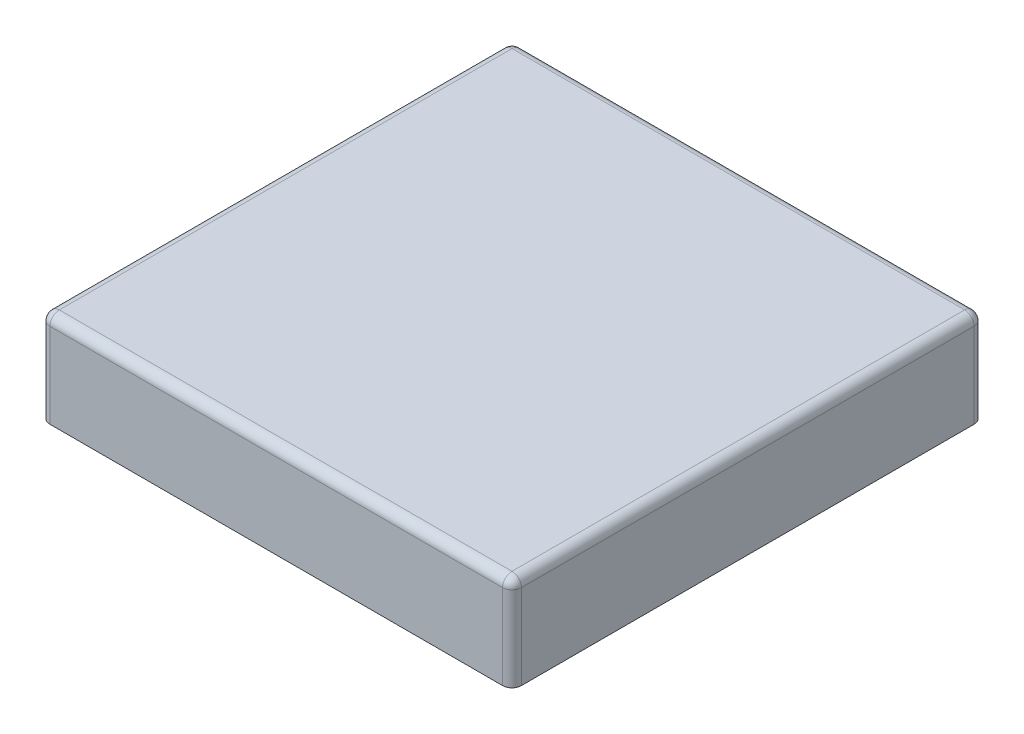
ISO-10303-21;
HEADER;
FILE_DESCRIPTION(('STEP AP214'),'2;1');
FILE_NAME('part.step','',(''),(''),'','','');
FILE_SCHEMA(('AUTOMOTIVE_DESIGN { 1 0 10303 214 1 1 1 1 }'));
ENDSEC;
DATA;
#1=APPLICATION_CONTEXT('core data for automotive mechanical design processes');
#2=APPLICATION_PROTOCOL_DEFINITION('international standard','automotive_design',2000,#1);
#3=PRODUCT_CONTEXT('',#1,'mechanical');
#4=PRODUCT('Part','Part','',(#3));
#5=PRODUCT_RELATED_PRODUCT_CATEGORY('part','',(#4));
#6=PRODUCT_DEFINITION_FORMATION('','',#4);
#7=PRODUCT_DEFINITION_CONTEXT('part definition',#1,'design');
#8=PRODUCT_DEFINITION('design','',#6,#7);
#9=PRODUCT_DEFINITION_SHAPE('','',#8);
#10=(LENGTH_UNIT() NAMED_UNIT(*) SI_UNIT(.MILLI.,.METRE.));
#11=(NAMED_UNIT(*) PLANE_ANGLE_UNIT() SI_UNIT($,.RADIAN.));
#12=(NAMED_UNIT(*) SI_UNIT($,.STERADIAN.) SOLID_ANGLE_UNIT());
#13=UNCERTAINTY_MEASURE_WITH_UNIT(LENGTH_MEASURE(1.E-05),#10,'distance_accuracy_value','');
#14=(GEOMETRIC_REPRESENTATION_CONTEXT(3) GLOBAL_UNCERTAINTY_ASSIGNED_CONTEXT((#13)) GLOBAL_UNIT_ASSIGNED_CONTEXT((#10,
#11,#12)) REPRESENTATION_CONTEXT('',''));
#15=CARTESIAN_POINT('',(0.,0.,0.));
#16=DIRECTION('',(0.,0.,1.));
#17=DIRECTION('',(1.,0.,0.));
#18=AXIS2_PLACEMENT_3D('',#15,#16,#17);
#19=CARTESIAN_POINT('',(0.,1.,0.));
#20=DIRECTION('',(1.,0.,0.));
#21=DIRECTION('',(0.,0.,-1.));
#22=AXIS2_PLACEMENT_3D('',#19,#20,#21);
#23=PLANE('',#22);
#24=DIRECTION('',(0.,0.,1.));
#25=VECTOR('',#24,1.);
#26=CARTESIAN_POINT('',(0.,0.9,0.));
#27=LINE('',#26,#25);
#28=CARTESIAN_POINT('',(0.,0.9,-0.1));
#29=VERTEX_POINT('',#28);
#30=CARTESIAN_POINT('',(0.,0.9,-4.9));
#31=VERTEX_POINT('',#30);
#32=EDGE_CURVE('E217',#29,#31,#27,.F.);
#33=ORIENTED_EDGE('',*,*,#32,.T.);
#34=DIRECTION('',(0.,-1.,0.));
#35=VECTOR('',#34,1.);
#36=CARTESIAN_POINT('',(0.,1.,-4.9));
#37=LINE('',#36,#35);
#38=CARTESIAN_POINT('',(0.,0.,-4.9));
#39=VERTEX_POINT('',#38);
#40=EDGE_CURVE('E11',#31,#39,#37,.T.);
#41=ORIENTED_EDGE('',*,*,#40,.T.);
#42=DIRECTION('',(0.,0.,1.));
#43=VECTOR('',#42,1.);
#44=CARTESIAN_POINT('',(0.,0.,0.));
#45=LINE('',#44,#43);
#46=CARTESIAN_POINT('',(0.,0.,-0.1));
#47=VERTEX_POINT('',#46);
#48=EDGE_CURVE('E183',#39,#47,#45,.T.);
#49=ORIENTED_EDGE('',*,*,#48,.T.);
#50=DIRECTION('',(0.,-1.,0.));
#51=VECTOR('',#50,1.);
#52=CARTESIAN_POINT('',(0.,1.,-0.1));
#53=LINE('',#52,#51);
#54=EDGE_CURVE('E43',#47,#29,#53,.F.);
#55=ORIENTED_EDGE('',*,*,#54,.T.);
#56=EDGE_LOOP('',(#33,#41,#49,#55));
#57=FACE_BOUND('',#56,.T.);
#58=ADVANCED_FACE('F34',(#57),#23,.F.);
#59=CARTESIAN_POINT('',(0.,1.,0.));
#60=DIRECTION('',(0.,0.,-1.));
#61=DIRECTION('',(-1.,0.,0.));
#62=AXIS2_PLACEMENT_3D('',#59,#60,#61);
#63=PLANE('',#62);
#64=DIRECTION('',(1.,0.,0.));
#65=VECTOR('',#64,1.);
#66=CARTESIAN_POINT('',(0.,0.,0.));
#67=LINE('',#66,#65);
#68=CARTESIAN_POINT('',(0.1,0.,0.));
#69=VERTEX_POINT('',#68);
#70=CARTESIAN_POINT('',(4.9,0.,0.));
#71=VERTEX_POINT('',#70);
#72=EDGE_CURVE('E202',#69,#71,#67,.T.);
#73=ORIENTED_EDGE('',*,*,#72,.T.);
#74=DIRECTION('',(0.,-1.,0.));
#75=VECTOR('',#74,1.);
#76=CARTESIAN_POINT('',(4.9,1.,0.));
#77=LINE('',#76,#75);
#78=CARTESIAN_POINT('',(4.9,0.9,0.));
#79=VERTEX_POINT('',#78);
#80=EDGE_CURVE('E173',#71,#79,#77,.F.);
#81=ORIENTED_EDGE('',*,*,#80,.T.);
#82=DIRECTION('',(1.,0.,0.));
#83=VECTOR('',#82,1.);
#84=CARTESIAN_POINT('',(0.,0.9,0.));
#85=LINE('',#84,#83);
#86=CARTESIAN_POINT('',(0.1,0.9,0.));
#87=VERTEX_POINT('',#86);
#88=EDGE_CURVE('E219',#79,#87,#85,.F.);
#89=ORIENTED_EDGE('',*,*,#88,.T.);
#90=DIRECTION('',(0.,-1.,0.));
#91=VECTOR('',#90,1.);
#92=CARTESIAN_POINT('',(0.1,1.,0.));
#93=LINE('',#92,#91);
#94=EDGE_CURVE('E58',#87,#69,#93,.T.);
#95=ORIENTED_EDGE('',*,*,#94,.T.);
#96=EDGE_LOOP('',(#73,#81,#89,#95));
#97=FACE_BOUND('',#96,.T.);
#98=ADVANCED_FACE('F240',(#97),#63,.F.);
#99=CARTESIAN_POINT('',(5.,1.,0.));
#100=DIRECTION('',(-1.,0.,0.));
#101=DIRECTION('',(0.,0.,1.));
#102=AXIS2_PLACEMENT_3D('',#99,#100,#101);
#103=PLANE('',#102);
#104=DIRECTION('',(0.,0.,-1.));
#105=VECTOR('',#104,1.);
#106=CARTESIAN_POINT('',(5.,0.9,0.));
#107=LINE('',#106,#105);
#108=CARTESIAN_POINT('',(5.,0.9,-4.9));
#109=VERTEX_POINT('',#108);
#110=CARTESIAN_POINT('',(5.,0.9,-0.1));
#111=VERTEX_POINT('',#110);
#112=EDGE_CURVE('E120',#109,#111,#107,.F.);
#113=ORIENTED_EDGE('',*,*,#112,.T.);
#114=DIRECTION('',(0.,-1.,0.));
#115=VECTOR('',#114,1.);
#116=CARTESIAN_POINT('',(5.,1.,-0.1));
#117=LINE('',#116,#115);
#118=CARTESIAN_POINT('',(5.,0.,-0.1));
#119=VERTEX_POINT('',#118);
#120=EDGE_CURVE('E163',#111,#119,#117,.T.);
#121=ORIENTED_EDGE('',*,*,#120,.T.);
#122=DIRECTION('',(0.,0.,-1.));
#123=VECTOR('',#122,1.);
#124=CARTESIAN_POINT('',(5.,0.,0.));
#125=LINE('',#124,#123);
#126=CARTESIAN_POINT('',(5.,0.,-4.9));
#127=VERTEX_POINT('',#126);
#128=EDGE_CURVE('E207',#119,#127,#125,.T.);
#129=ORIENTED_EDGE('',*,*,#128,.T.);
#130=DIRECTION('',(0.,-1.,0.));
#131=VECTOR('',#130,1.);
#132=CARTESIAN_POINT('',(5.,1.,-4.9));
#133=LINE('',#132,#131);
#134=EDGE_CURVE('E161',#127,#109,#133,.F.);
#135=ORIENTED_EDGE('',*,*,#134,.T.);
#136=EDGE_LOOP('',(#113,#121,#129,#135));
#137=FACE_BOUND('',#136,.T.);
#138=ADVANCED_FACE('F230',(#137),#103,.F.);
#139=CARTESIAN_POINT('',(0.,1.,-5.));
#140=DIRECTION('',(0.,0.,1.));
#141=DIRECTION('',(1.,0.,0.));
#142=AXIS2_PLACEMENT_3D('',#139,#140,#141);
#143=PLANE('',#142);
#144=DIRECTION('',(-1.,0.,0.));
#145=VECTOR('',#144,1.);
#146=CARTESIAN_POINT('',(0.,0.9,-5.));
#147=LINE('',#146,#145);
#148=CARTESIAN_POINT('',(0.1,0.9,-5.));
#149=VERTEX_POINT('',#148);
#150=CARTESIAN_POINT('',(4.9,0.9,-5.));
#151=VERTEX_POINT('',#150);
#152=EDGE_CURVE('E222',#149,#151,#147,.F.);
#153=ORIENTED_EDGE('',*,*,#152,.T.);
#154=DIRECTION('',(0.,-1.,0.));
#155=VECTOR('',#154,1.);
#156=CARTESIAN_POINT('',(4.9,1.,-5.));
#157=LINE('',#156,#155);
#158=CARTESIAN_POINT('',(4.9,0.,-5.));
#159=VERTEX_POINT('',#158);
#160=EDGE_CURVE('E177',#151,#159,#157,.T.);
#161=ORIENTED_EDGE('',*,*,#160,.T.);
#162=DIRECTION('',(-1.,0.,0.));
#163=VECTOR('',#162,1.);
#164=CARTESIAN_POINT('',(0.,0.,-5.));
#165=LINE('',#164,#163);
#166=CARTESIAN_POINT('',(0.1,0.,-5.));
#167=VERTEX_POINT('',#166);
#168=EDGE_CURVE('E146',#159,#167,#165,.T.);
#169=ORIENTED_EDGE('',*,*,#168,.T.);
#170=DIRECTION('',(0.,-1.,0.));
#171=VECTOR('',#170,1.);
#172=CARTESIAN_POINT('',(0.1,1.,-5.));
#173=LINE('',#172,#171);
#174=EDGE_CURVE('E175',#167,#149,#173,.F.);
#175=ORIENTED_EDGE('',*,*,#174,.T.);
#176=EDGE_LOOP('',(#153,#161,#169,#175));
#177=FACE_BOUND('',#176,.T.);
#178=ADVANCED_FACE('F247',(#177),#143,.F.);
#179=CARTESIAN_POINT('',(0.,1.,0.));
#180=DIRECTION('',(0.,-1.,0.));
#181=DIRECTION('',(0.,0.,-1.));
#182=AXIS2_PLACEMENT_3D('',#179,#180,#181);
#183=PLANE('',#182);
#184=DIRECTION('',(-1.,0.,0.));
#185=VECTOR('',#184,1.);
#186=CARTESIAN_POINT('',(0.,1.,-4.9));
#187=LINE('',#186,#185);
#188=CARTESIAN_POINT('',(4.9,1.,-4.9));
#189=VERTEX_POINT('',#188);
#190=CARTESIAN_POINT('',(0.1,1.,-4.9));
#191=VERTEX_POINT('',#190);
#192=EDGE_CURVE('E133',#189,#191,#187,.T.);
#193=ORIENTED_EDGE('',*,*,#192,.T.);
#194=DIRECTION('',(0.,0.,1.));
#195=VECTOR('',#194,1.);
#196=CARTESIAN_POINT('',(0.1,1.,0.));
#197=LINE('',#196,#195);
#198=CARTESIAN_POINT('',(0.1,1.,-0.1));
#199=VERTEX_POINT('',#198);
#200=EDGE_CURVE('E215',#191,#199,#197,.T.);
#201=ORIENTED_EDGE('',*,*,#200,.T.);
#202=DIRECTION('',(1.,0.,0.));
#203=VECTOR('',#202,1.);
#204=CARTESIAN_POINT('',(0.,1.,-0.1));
#205=LINE('',#204,#203);
#206=CARTESIAN_POINT('',(4.9,1.,-0.1));
#207=VERTEX_POINT('',#206);
#208=EDGE_CURVE('E136',#199,#207,#205,.T.);
#209=ORIENTED_EDGE('',*,*,#208,.T.);
#210=DIRECTION('',(0.,0.,-1.));
#211=VECTOR('',#210,1.);
#212=CARTESIAN_POINT('',(4.9,1.,0.));
#213=LINE('',#212,#211);
#214=EDGE_CURVE('E118',#207,#189,#213,.T.);
#215=ORIENTED_EDGE('',*,*,#214,.T.);
#216=EDGE_LOOP('',(#193,#201,#209,#215));
#217=FACE_BOUND('',#216,.T.);
#218=ADVANCED_FACE('F131',(#217),#183,.F.);
#219=CARTESIAN_POINT('',(0.,0.,0.));
#220=DIRECTION('',(0.,-1.,0.));
#221=DIRECTION('',(0.,0.,-1.));
#222=AXIS2_PLACEMENT_3D('',#219,#220,#221);
#223=PLANE('',#222);
#224=ORIENTED_EDGE('',*,*,#128,.F.);
#225=CARTESIAN_POINT('',(4.9,0.,-0.1));
#226=DIRECTION('',(0.,-1.,0.));
#227=DIRECTION('',(0.,0.,-1.));
#228=AXIS2_PLACEMENT_3D('',#225,#226,#227);
#229=CIRCLE('',#228,0.1);
#230=EDGE_CURVE('E51',#119,#71,#229,.T.);
#231=ORIENTED_EDGE('',*,*,#230,.T.);
#232=ORIENTED_EDGE('',*,*,#72,.F.);
#233=CARTESIAN_POINT('',(0.1,0.,-0.1));
#234=DIRECTION('',(0.,-1.,0.));
#235=DIRECTION('',(0.,0.,-1.));
#236=AXIS2_PLACEMENT_3D('',#233,#234,#235);
#237=CIRCLE('',#236,0.1);
#238=EDGE_CURVE('E165',#69,#47,#237,.T.);
#239=ORIENTED_EDGE('',*,*,#238,.T.);
#240=ORIENTED_EDGE('',*,*,#48,.F.);
#241=CARTESIAN_POINT('',(0.1,0.,-4.9));
#242=DIRECTION('',(0.,-1.,0.));
#243=DIRECTION('',(0.,0.,-1.));
#244=AXIS2_PLACEMENT_3D('',#241,#242,#243);
#245=CIRCLE('',#244,0.1);
#246=EDGE_CURVE('E167',#39,#167,#245,.T.);
#247=ORIENTED_EDGE('',*,*,#246,.T.);
#248=ORIENTED_EDGE('',*,*,#168,.F.);
#249=CARTESIAN_POINT('',(4.9,0.,-4.9));
#250=DIRECTION('',(0.,-1.,0.));
#251=DIRECTION('',(0.,0.,-1.));
#252=AXIS2_PLACEMENT_3D('',#249,#250,#251);
#253=CIRCLE('',#252,0.1);
#254=EDGE_CURVE('E169',#159,#127,#253,.T.);
#255=ORIENTED_EDGE('',*,*,#254,.T.);
#256=EDGE_LOOP('',(#224,#231,#232,#239,#240,#247,#248,#255));
#257=FACE_BOUND('',#256,.T.);
#258=ADVANCED_FACE('F200',(#257),#223,.T.);
#259=CARTESIAN_POINT('',(4.9,0.9,0.));
#260=DIRECTION('',(0.,0.,-1.));
#261=DIRECTION('',(-1.,0.,0.));
#262=AXIS2_PLACEMENT_3D('',#259,#260,#261);
#263=CYLINDRICAL_SURFACE('',#262,0.1);
#264=ORIENTED_EDGE('',*,*,#214,.F.);
#265=CARTESIAN_POINT('',(4.9,0.9,-0.1));
#266=DIRECTION('',(0.,0.,-1.));
#267=DIRECTION('',(-1.,0.,0.));
#268=AXIS2_PLACEMENT_3D('',#265,#266,#267);
#269=CIRCLE('',#268,0.1);
#270=EDGE_CURVE('E124',#207,#111,#269,.T.);
#271=ORIENTED_EDGE('',*,*,#270,.T.);
#272=ORIENTED_EDGE('',*,*,#112,.F.);
#273=CARTESIAN_POINT('',(4.9,0.9,-4.9));
#274=DIRECTION('',(0.,0.,-1.));
#275=DIRECTION('',(-1.,0.,0.));
#276=AXIS2_PLACEMENT_3D('',#273,#274,#275);
#277=CIRCLE('',#276,0.1);
#278=EDGE_CURVE('E115',#109,#189,#277,.F.);
#279=ORIENTED_EDGE('',*,*,#278,.T.);
#280=EDGE_LOOP('',(#264,#271,#272,#279));
#281=FACE_BOUND('',#280,.T.);
#282=ADVANCED_FACE('F117',(#281),#263,.T.);
#283=CARTESIAN_POINT('',(0.,0.9,-4.9));
#284=DIRECTION('',(-1.,0.,0.));
#285=DIRECTION('',(0.,0.,1.));
#286=AXIS2_PLACEMENT_3D('',#283,#284,#285);
#287=CYLINDRICAL_SURFACE('',#286,0.1);
#288=ORIENTED_EDGE('',*,*,#192,.F.);
#289=CARTESIAN_POINT('',(4.9,0.9,-4.9));
#290=DIRECTION('',(-1.,0.,0.));
#291=DIRECTION('',(0.,0.,1.));
#292=AXIS2_PLACEMENT_3D('',#289,#290,#291);
#293=CIRCLE('',#292,0.1);
#294=EDGE_CURVE('E142',#189,#151,#293,.T.);
#295=ORIENTED_EDGE('',*,*,#294,.T.);
#296=ORIENTED_EDGE('',*,*,#152,.F.);
#297=CARTESIAN_POINT('',(0.1,0.9,-4.9));
#298=DIRECTION('',(-1.,0.,0.));
#299=DIRECTION('',(0.,0.,1.));
#300=AXIS2_PLACEMENT_3D('',#297,#298,#299);
#301=CIRCLE('',#300,0.1);
#302=EDGE_CURVE('E145',#149,#191,#301,.F.);
#303=ORIENTED_EDGE('',*,*,#302,.T.);
#304=EDGE_LOOP('',(#288,#295,#296,#303));
#305=FACE_BOUND('',#304,.T.);
#306=ADVANCED_FACE('F140',(#305),#287,.T.);
#307=CARTESIAN_POINT('',(0.,0.9,-0.1));
#308=DIRECTION('',(1.,0.,0.));
#309=DIRECTION('',(0.,0.,-1.));
#310=AXIS2_PLACEMENT_3D('',#307,#308,#309);
#311=CYLINDRICAL_SURFACE('',#310,0.1);
#312=ORIENTED_EDGE('',*,*,#88,.F.);
#313=CARTESIAN_POINT('',(4.9,0.9,-0.1));
#314=DIRECTION('',(1.,0.,0.));
#315=DIRECTION('',(0.,0.,-1.));
#316=AXIS2_PLACEMENT_3D('',#313,#314,#315);
#317=CIRCLE('',#316,0.1);
#318=EDGE_CURVE('E125',#79,#207,#317,.F.);
#319=ORIENTED_EDGE('',*,*,#318,.T.);
#320=ORIENTED_EDGE('',*,*,#208,.F.);
#321=CARTESIAN_POINT('',(0.1,0.9,-0.1));
#322=DIRECTION('',(1.,0.,0.));
#323=DIRECTION('',(0.,0.,-1.));
#324=AXIS2_PLACEMENT_3D('',#321,#322,#323);
#325=CIRCLE('',#324,0.1);
#326=EDGE_CURVE('E194',#199,#87,#325,.T.);
#327=ORIENTED_EDGE('',*,*,#326,.T.);
#328=EDGE_LOOP('',(#312,#319,#320,#327));
#329=FACE_BOUND('',#328,.T.);
#330=ADVANCED_FACE('F239',(#329),#311,.T.);
#331=CARTESIAN_POINT('',(0.1,0.9,0.));
#332=DIRECTION('',(0.,0.,1.));
#333=DIRECTION('',(1.,0.,0.));
#334=AXIS2_PLACEMENT_3D('',#331,#332,#333);
#335=CYLINDRICAL_SURFACE('',#334,0.1);
#336=ORIENTED_EDGE('',*,*,#200,.F.);
#337=CARTESIAN_POINT('',(0.1,0.9,-4.9));
#338=DIRECTION('',(0.,0.,1.));
#339=DIRECTION('',(1.,0.,0.));
#340=AXIS2_PLACEMENT_3D('',#337,#338,#339);
#341=CIRCLE('',#340,0.1);
#342=EDGE_CURVE('E154',#191,#31,#341,.T.);
#343=ORIENTED_EDGE('',*,*,#342,.T.);
#344=ORIENTED_EDGE('',*,*,#32,.F.);
#345=CARTESIAN_POINT('',(0.1,0.9,-0.1));
#346=DIRECTION('',(0.,0.,1.));
#347=DIRECTION('',(1.,0.,0.));
#348=AXIS2_PLACEMENT_3D('',#345,#346,#347);
#349=CIRCLE('',#348,0.1);
#350=EDGE_CURVE('E151',#29,#199,#349,.F.);
#351=ORIENTED_EDGE('',*,*,#350,.T.);
#352=EDGE_LOOP('',(#336,#343,#344,#351));
#353=FACE_BOUND('',#352,.T.);
#354=ADVANCED_FACE('F252',(#353),#335,.T.);
#355=CARTESIAN_POINT('',(4.9,1.,-0.1));
#356=DIRECTION('',(0.,-1.,0.));
#357=DIRECTION('',(0.,0.,-1.));
#358=AXIS2_PLACEMENT_3D('',#355,#356,#357);
#359=CYLINDRICAL_SURFACE('',#358,0.1);
#360=ORIENTED_EDGE('',*,*,#230,.F.);
#361=ORIENTED_EDGE('',*,*,#120,.F.);
#362=CARTESIAN_POINT('',(4.9,0.9,-0.1));
#363=DIRECTION('',(0.,1.,0.));
#364=DIRECTION('',(0.,0.,1.));
#365=AXIS2_PLACEMENT_3D('',#362,#363,#364);
#366=CIRCLE('',#365,0.1);
#367=EDGE_CURVE('E180',#79,#111,#366,.T.);
#368=ORIENTED_EDGE('',*,*,#367,.F.);
#369=ORIENTED_EDGE('',*,*,#80,.F.);
#370=EDGE_LOOP('',(#360,#361,#368,#369));
#371=FACE_BOUND('',#370,.T.);
#372=ADVANCED_FACE('F234',(#371),#359,.T.);
#373=CARTESIAN_POINT('',(4.9,0.9,-0.1));
#374=DIRECTION('',(0.,0.,1.));
#375=DIRECTION('',(1.,0.,0.));
#376=AXIS2_PLACEMENT_3D('',#373,#374,#375);
#377=SPHERICAL_SURFACE('',#376,0.1);
#378=ORIENTED_EDGE('',*,*,#367,.T.);
#379=ORIENTED_EDGE('',*,*,#270,.F.);
#380=ORIENTED_EDGE('',*,*,#318,.F.);
#381=EDGE_LOOP('',(#378,#379,#380));
#382=FACE_BOUND('',#381,.T.);
#383=ADVANCED_FACE('F236',(#382),#377,.T.);
#384=CARTESIAN_POINT('',(4.9,1.,-4.9));
#385=DIRECTION('',(0.,-1.,0.));
#386=DIRECTION('',(0.,0.,-1.));
#387=AXIS2_PLACEMENT_3D('',#384,#385,#386);
#388=CYLINDRICAL_SURFACE('',#387,0.1);
#389=ORIENTED_EDGE('',*,*,#254,.F.);
#390=ORIENTED_EDGE('',*,*,#160,.F.);
#391=CARTESIAN_POINT('',(4.9,0.9,-4.9));
#392=DIRECTION('',(0.,1.,0.));
#393=DIRECTION('',(0.,0.,1.));
#394=AXIS2_PLACEMENT_3D('',#391,#392,#393);
#395=CIRCLE('',#394,0.1);
#396=EDGE_CURVE('E149',#109,#151,#395,.T.);
#397=ORIENTED_EDGE('',*,*,#396,.F.);
#398=ORIENTED_EDGE('',*,*,#134,.F.);
#399=EDGE_LOOP('',(#389,#390,#397,#398));
#400=FACE_BOUND('',#399,.T.);
#401=ADVANCED_FACE('F264',(#400),#388,.T.);
#402=CARTESIAN_POINT('',(4.9,0.9,-4.9));
#403=DIRECTION('',(0.,0.,1.));
#404=DIRECTION('',(1.,0.,0.));
#405=AXIS2_PLACEMENT_3D('',#402,#403,#404);
#406=SPHERICAL_SURFACE('',#405,0.1);
#407=ORIENTED_EDGE('',*,*,#294,.F.);
#408=ORIENTED_EDGE('',*,*,#278,.F.);
#409=ORIENTED_EDGE('',*,*,#396,.T.);
#410=EDGE_LOOP('',(#407,#408,#409));
#411=FACE_BOUND('',#410,.T.);
#412=ADVANCED_FACE('F148',(#411),#406,.T.);
#413=CARTESIAN_POINT('',(0.1,1.,-4.9));
#414=DIRECTION('',(0.,-1.,0.));
#415=DIRECTION('',(0.,0.,-1.));
#416=AXIS2_PLACEMENT_3D('',#413,#414,#415);
#417=CYLINDRICAL_SURFACE('',#416,0.1);
#418=ORIENTED_EDGE('',*,*,#246,.F.);
#419=ORIENTED_EDGE('',*,*,#40,.F.);
#420=CARTESIAN_POINT('',(0.1,0.9,-4.9));
#421=DIRECTION('',(0.,1.,0.));
#422=DIRECTION('',(0.,0.,1.));
#423=AXIS2_PLACEMENT_3D('',#420,#421,#422);
#424=CIRCLE('',#423,0.1);
#425=EDGE_CURVE('E184',#149,#31,#424,.T.);
#426=ORIENTED_EDGE('',*,*,#425,.F.);
#427=ORIENTED_EDGE('',*,*,#174,.F.);
#428=EDGE_LOOP('',(#418,#419,#426,#427));
#429=FACE_BOUND('',#428,.T.);
#430=ADVANCED_FACE('F269',(#429),#417,.T.);
#431=CARTESIAN_POINT('',(0.1,0.9,-4.9));
#432=DIRECTION('',(0.,0.,1.));
#433=DIRECTION('',(1.,0.,0.));
#434=AXIS2_PLACEMENT_3D('',#431,#432,#433);
#435=SPHERICAL_SURFACE('',#434,0.1);
#436=ORIENTED_EDGE('',*,*,#342,.F.);
#437=ORIENTED_EDGE('',*,*,#302,.F.);
#438=ORIENTED_EDGE('',*,*,#425,.T.);
#439=EDGE_LOOP('',(#436,#437,#438));
#440=FACE_BOUND('',#439,.T.);
#441=ADVANCED_FACE('F273',(#440),#435,.T.);
#442=CARTESIAN_POINT('',(0.1,1.,-0.1));
#443=DIRECTION('',(0.,-1.,0.));
#444=DIRECTION('',(0.,0.,-1.));
#445=AXIS2_PLACEMENT_3D('',#442,#443,#444);
#446=CYLINDRICAL_SURFACE('',#445,0.1);
#447=ORIENTED_EDGE('',*,*,#238,.F.);
#448=ORIENTED_EDGE('',*,*,#94,.F.);
#449=CARTESIAN_POINT('',(0.1,0.9,-0.1));
#450=DIRECTION('',(0.,1.,0.));
#451=DIRECTION('',(0.,0.,1.));
#452=AXIS2_PLACEMENT_3D('',#449,#450,#451);
#453=CIRCLE('',#452,0.1);
#454=EDGE_CURVE('E38',#29,#87,#453,.T.);
#455=ORIENTED_EDGE('',*,*,#454,.F.);
#456=ORIENTED_EDGE('',*,*,#54,.F.);
#457=EDGE_LOOP('',(#447,#448,#455,#456));
#458=FACE_BOUND('',#457,.T.);
#459=ADVANCED_FACE('F36',(#458),#446,.T.);
#460=CARTESIAN_POINT('',(0.1,0.9,-0.1));
#461=DIRECTION('',(0.,0.,1.));
#462=DIRECTION('',(1.,0.,0.));
#463=AXIS2_PLACEMENT_3D('',#460,#461,#462);
#464=SPHERICAL_SURFACE('',#463,0.1);
#465=ORIENTED_EDGE('',*,*,#454,.T.);
#466=ORIENTED_EDGE('',*,*,#326,.F.);
#467=ORIENTED_EDGE('',*,*,#350,.F.);
#468=EDGE_LOOP('',(#465,#466,#467));
#469=FACE_BOUND('',#468,.T.);
#470=ADVANCED_FACE('F193',(#469),#464,.T.);
#471=CLOSED_SHELL('',(#58,#98,#138,#178,#218,#258,#282,#306,#330,#354,#372,#383,#401,#412,#430,
#441,#459,#470));
#472=MANIFOLD_SOLID_BREP('B2',#471);
#473=ADVANCED_BREP_SHAPE_REPRESENTATION('',(#18,#472),#14);
#474=SHAPE_DEFINITION_REPRESENTATION(#9,#473);
ENDSEC;
END-ISO-10303-21;
